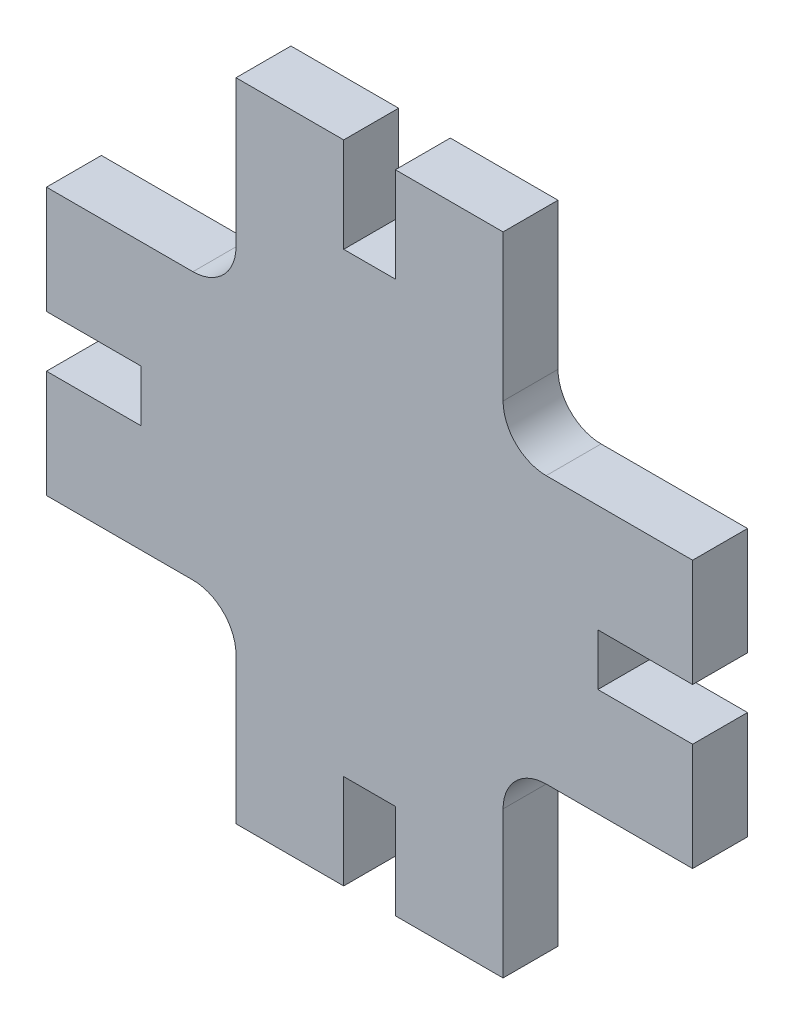
ISO-10303-21;
HEADER;
FILE_DESCRIPTION(('STEP AP214'),'2;1');
FILE_NAME('part.step','',(''),(''),'','','');
FILE_SCHEMA(('AUTOMOTIVE_DESIGN { 1 0 10303 214 1 1 1 1 }'));
ENDSEC;
DATA;
#1=APPLICATION_CONTEXT('core data for automotive mechanical design processes');
#2=APPLICATION_PROTOCOL_DEFINITION('international standard','automotive_design',2000,#1);
#3=PRODUCT_CONTEXT('',#1,'mechanical');
#4=PRODUCT('Part','Part','',(#3));
#5=PRODUCT_RELATED_PRODUCT_CATEGORY('part','',(#4));
#6=PRODUCT_DEFINITION_FORMATION('','',#4);
#7=PRODUCT_DEFINITION_CONTEXT('part definition',#1,'design');
#8=PRODUCT_DEFINITION('design','',#6,#7);
#9=PRODUCT_DEFINITION_SHAPE('','',#8);
#10=(LENGTH_UNIT() NAMED_UNIT(*) SI_UNIT(.MILLI.,.METRE.));
#11=(NAMED_UNIT(*) PLANE_ANGLE_UNIT() SI_UNIT($,.RADIAN.));
#12=(NAMED_UNIT(*) SI_UNIT($,.STERADIAN.) SOLID_ANGLE_UNIT());
#13=UNCERTAINTY_MEASURE_WITH_UNIT(LENGTH_MEASURE(1.E-05),#10,'distance_accuracy_value','');
#14=(GEOMETRIC_REPRESENTATION_CONTEXT(3) GLOBAL_UNCERTAINTY_ASSIGNED_CONTEXT((#13)) GLOBAL_UNIT_ASSIGNED_CONTEXT((#10,
#11,#12)) REPRESENTATION_CONTEXT('',''));
#15=CARTESIAN_POINT('',(0.,0.,0.));
#16=DIRECTION('',(0.,0.,1.));
#17=DIRECTION('',(1.,0.,0.));
#18=AXIS2_PLACEMENT_3D('',#15,#16,#17);
#19=CARTESIAN_POINT('',(0.,0.,5.1));
#20=DIRECTION('',(1.,0.,0.));
#21=DIRECTION('',(0.,1.,0.));
#22=AXIS2_PLACEMENT_3D('',#19,#20,#21);
#23=PLANE('',#22);
#24=DIRECTION('',(0.,-1.,0.));
#25=VECTOR('',#24,1.);
#26=CARTESIAN_POINT('',(0.,0.,0.));
#27=LINE('',#26,#25);
#28=CARTESIAN_POINT('',(0.,13.6,0.));
#29=VERTEX_POINT('',#28);
#30=CARTESIAN_POINT('',(0.,0.,0.));
#31=VERTEX_POINT('',#30);
#32=EDGE_CURVE('E273',#29,#31,#27,.T.);
#33=ORIENTED_EDGE('',*,*,#32,.T.);
#34=DIRECTION('',(0.,0.,-1.));
#35=VECTOR('',#34,1.);
#36=CARTESIAN_POINT('',(0.,0.,5.1));
#37=LINE('',#36,#35);
#38=CARTESIAN_POINT('',(0.,0.,5.1));
#39=VERTEX_POINT('',#38);
#40=EDGE_CURVE('E11',#39,#31,#37,.T.);
#41=ORIENTED_EDGE('',*,*,#40,.F.);
#42=DIRECTION('',(0.,-1.,0.));
#43=VECTOR('',#42,1.);
#44=CARTESIAN_POINT('',(0.,0.,5.1));
#45=LINE('',#44,#43);
#46=CARTESIAN_POINT('',(0.,13.6,5.1));
#47=VERTEX_POINT('',#46);
#48=EDGE_CURVE('E335',#47,#39,#45,.T.);
#49=ORIENTED_EDGE('',*,*,#48,.F.);
#50=DIRECTION('',(0.,0.,-1.));
#51=VECTOR('',#50,1.);
#52=CARTESIAN_POINT('',(0.,13.6,5.1));
#53=LINE('',#52,#51);
#54=EDGE_CURVE('E269',#47,#29,#53,.T.);
#55=ORIENTED_EDGE('',*,*,#54,.T.);
#56=EDGE_LOOP('',(#33,#41,#49,#55));
#57=FACE_BOUND('',#56,.T.);
#58=ADVANCED_FACE('F33',(#57),#23,.F.);
#59=CARTESIAN_POINT('',(0.,0.,5.1));
#60=DIRECTION('',(0.,1.,0.));
#61=DIRECTION('',(-1.,0.,0.));
#62=AXIS2_PLACEMENT_3D('',#59,#60,#61);
#63=PLANE('',#62);
#64=DIRECTION('',(1.,0.,0.));
#65=VECTOR('',#64,1.);
#66=CARTESIAN_POINT('',(0.,0.,0.));
#67=LINE('',#66,#65);
#68=CARTESIAN_POINT('',(10.,0.,0.));
#69=VERTEX_POINT('',#68);
#70=EDGE_CURVE('E276',#31,#69,#67,.T.);
#71=ORIENTED_EDGE('',*,*,#70,.T.);
#72=DIRECTION('',(0.,0.,-1.));
#73=VECTOR('',#72,1.);
#74=CARTESIAN_POINT('',(10.,0.,5.1));
#75=LINE('',#74,#73);
#76=CARTESIAN_POINT('',(10.,0.,5.1));
#77=VERTEX_POINT('',#76);
#78=EDGE_CURVE('E41',#77,#69,#75,.T.);
#79=ORIENTED_EDGE('',*,*,#78,.F.);
#80=DIRECTION('',(1.,0.,0.));
#81=VECTOR('',#80,1.);
#82=CARTESIAN_POINT('',(0.,0.,5.1));
#83=LINE('',#82,#81);
#84=EDGE_CURVE('E164',#39,#77,#83,.T.);
#85=ORIENTED_EDGE('',*,*,#84,.F.);
#86=ORIENTED_EDGE('',*,*,#40,.T.);
#87=EDGE_LOOP('',(#71,#79,#85,#86));
#88=FACE_BOUND('',#87,.T.);
#89=ADVANCED_FACE('F513',(#88),#63,.F.);
#90=CARTESIAN_POINT('',(10.,0.,5.1));
#91=DIRECTION('',(-1.,0.,0.));
#92=DIRECTION('',(0.,-1.,0.));
#93=AXIS2_PLACEMENT_3D('',#90,#91,#92);
#94=PLANE('',#93);
#95=DIRECTION('',(0.,1.,0.));
#96=VECTOR('',#95,1.);
#97=CARTESIAN_POINT('',(10.,0.,0.));
#98=LINE('',#97,#96);
#99=CARTESIAN_POINT('',(10.,8.8,0.));
#100=VERTEX_POINT('',#99);
#101=EDGE_CURVE('E278',#69,#100,#98,.T.);
#102=ORIENTED_EDGE('',*,*,#101,.T.);
#103=DIRECTION('',(0.,0.,-1.));
#104=VECTOR('',#103,1.);
#105=CARTESIAN_POINT('',(10.,8.8,5.1));
#106=LINE('',#105,#104);
#107=CARTESIAN_POINT('',(10.,8.8,5.1));
#108=VERTEX_POINT('',#107);
#109=EDGE_CURVE('E414',#108,#100,#106,.T.);
#110=ORIENTED_EDGE('',*,*,#109,.F.);
#111=DIRECTION('',(0.,1.,0.));
#112=VECTOR('',#111,1.);
#113=CARTESIAN_POINT('',(10.,0.,5.1));
#114=LINE('',#113,#112);
#115=EDGE_CURVE('E422',#77,#108,#114,.T.);
#116=ORIENTED_EDGE('',*,*,#115,.F.);
#117=ORIENTED_EDGE('',*,*,#78,.T.);
#118=EDGE_LOOP('',(#102,#110,#116,#117));
#119=FACE_BOUND('',#118,.T.);
#120=ADVANCED_FACE('F420',(#119),#94,.F.);
#121=CARTESIAN_POINT('',(10.,8.8,5.1));
#122=DIRECTION('',(0.,1.,0.));
#123=DIRECTION('',(0.,0.,1.));
#124=AXIS2_PLACEMENT_3D('',#121,#122,#123);
#125=PLANE('',#124);
#126=DIRECTION('',(1.,0.,0.));
#127=VECTOR('',#126,1.);
#128=CARTESIAN_POINT('',(10.,8.8,0.));
#129=LINE('',#128,#127);
#130=CARTESIAN_POINT('',(14.8,8.8,0.));
#131=VERTEX_POINT('',#130);
#132=EDGE_CURVE('E280',#100,#131,#129,.T.);
#133=ORIENTED_EDGE('',*,*,#132,.T.);
#134=DIRECTION('',(0.,0.,-1.));
#135=VECTOR('',#134,1.);
#136=CARTESIAN_POINT('',(14.8,8.8,5.1));
#137=LINE('',#136,#135);
#138=CARTESIAN_POINT('',(14.8,8.8,5.1));
#139=VERTEX_POINT('',#138);
#140=EDGE_CURVE('E411',#139,#131,#137,.T.);
#141=ORIENTED_EDGE('',*,*,#140,.F.);
#142=DIRECTION('',(1.,0.,0.));
#143=VECTOR('',#142,1.);
#144=CARTESIAN_POINT('',(10.,8.8,5.1));
#145=LINE('',#144,#143);
#146=EDGE_CURVE('E440',#108,#139,#145,.T.);
#147=ORIENTED_EDGE('',*,*,#146,.F.);
#148=ORIENTED_EDGE('',*,*,#109,.T.);
#149=EDGE_LOOP('',(#133,#141,#147,#148));
#150=FACE_BOUND('',#149,.T.);
#151=ADVANCED_FACE('F431',(#150),#125,.F.);
#152=CARTESIAN_POINT('',(14.8,8.8,5.1));
#153=DIRECTION('',(1.,0.,0.));
#154=DIRECTION('',(0.,1.,0.));
#155=AXIS2_PLACEMENT_3D('',#152,#153,#154);
#156=PLANE('',#155);
#157=DIRECTION('',(0.,-1.,0.));
#158=VECTOR('',#157,1.);
#159=CARTESIAN_POINT('',(14.8,8.8,0.));
#160=LINE('',#159,#158);
#161=CARTESIAN_POINT('',(14.8,0.,0.));
#162=VERTEX_POINT('',#161);
#163=EDGE_CURVE('E282',#131,#162,#160,.T.);
#164=ORIENTED_EDGE('',*,*,#163,.T.);
#165=DIRECTION('',(0.,0.,-1.));
#166=VECTOR('',#165,1.);
#167=CARTESIAN_POINT('',(14.8,0.,5.1));
#168=LINE('',#167,#166);
#169=CARTESIAN_POINT('',(14.8,0.,5.1));
#170=VERTEX_POINT('',#169);
#171=EDGE_CURVE('E408',#170,#162,#168,.T.);
#172=ORIENTED_EDGE('',*,*,#171,.F.);
#173=DIRECTION('',(0.,-1.,0.));
#174=VECTOR('',#173,1.);
#175=CARTESIAN_POINT('',(14.8,8.8,5.1));
#176=LINE('',#175,#174);
#177=EDGE_CURVE('E437',#139,#170,#176,.T.);
#178=ORIENTED_EDGE('',*,*,#177,.F.);
#179=ORIENTED_EDGE('',*,*,#140,.T.);
#180=EDGE_LOOP('',(#164,#172,#178,#179));
#181=FACE_BOUND('',#180,.T.);
#182=ADVANCED_FACE('F435',(#181),#156,.F.);
#183=CARTESIAN_POINT('',(14.8,0.,5.1));
#184=DIRECTION('',(0.,1.,0.));
#185=DIRECTION('',(-1.,0.,0.));
#186=AXIS2_PLACEMENT_3D('',#183,#184,#185);
#187=PLANE('',#186);
#188=DIRECTION('',(1.,0.,0.));
#189=VECTOR('',#188,1.);
#190=CARTESIAN_POINT('',(14.8,0.,0.));
#191=LINE('',#190,#189);
#192=CARTESIAN_POINT('',(24.8,0.,0.));
#193=VERTEX_POINT('',#192);
#194=EDGE_CURVE('E284',#162,#193,#191,.T.);
#195=ORIENTED_EDGE('',*,*,#194,.T.);
#196=DIRECTION('',(0.,0.,-1.));
#197=VECTOR('',#196,1.);
#198=CARTESIAN_POINT('',(24.8,0.,5.1));
#199=LINE('',#198,#197);
#200=CARTESIAN_POINT('',(24.8,0.,5.1));
#201=VERTEX_POINT('',#200);
#202=EDGE_CURVE('E405',#201,#193,#199,.T.);
#203=ORIENTED_EDGE('',*,*,#202,.F.);
#204=DIRECTION('',(1.,0.,0.));
#205=VECTOR('',#204,1.);
#206=CARTESIAN_POINT('',(14.8,0.,5.1));
#207=LINE('',#206,#205);
#208=EDGE_CURVE('E439',#170,#201,#207,.T.);
#209=ORIENTED_EDGE('',*,*,#208,.F.);
#210=ORIENTED_EDGE('',*,*,#171,.T.);
#211=EDGE_LOOP('',(#195,#203,#209,#210));
#212=FACE_BOUND('',#211,.T.);
#213=ADVANCED_FACE('F526',(#212),#187,.F.);
#214=CARTESIAN_POINT('',(24.8,0.,5.1));
#215=DIRECTION('',(-1.,0.,0.));
#216=DIRECTION('',(0.,-1.,0.));
#217=AXIS2_PLACEMENT_3D('',#214,#215,#216);
#218=PLANE('',#217);
#219=DIRECTION('',(0.,1.,0.));
#220=VECTOR('',#219,1.);
#221=CARTESIAN_POINT('',(24.8,0.,0.));
#222=LINE('',#221,#220);
#223=CARTESIAN_POINT('',(24.8,13.6,0.));
#224=VERTEX_POINT('',#223);
#225=EDGE_CURVE('E286',#193,#224,#222,.T.);
#226=ORIENTED_EDGE('',*,*,#225,.T.);
#227=DIRECTION('',(0.,0.,-1.));
#228=VECTOR('',#227,1.);
#229=CARTESIAN_POINT('',(24.8,13.6,5.1));
#230=LINE('',#229,#228);
#231=CARTESIAN_POINT('',(24.8,13.6,5.1));
#232=VERTEX_POINT('',#231);
#233=EDGE_CURVE('E402',#232,#224,#230,.T.);
#234=ORIENTED_EDGE('',*,*,#233,.F.);
#235=DIRECTION('',(0.,1.,0.));
#236=VECTOR('',#235,1.);
#237=CARTESIAN_POINT('',(24.8,0.,5.1));
#238=LINE('',#237,#236);
#239=EDGE_CURVE('E442',#201,#232,#238,.T.);
#240=ORIENTED_EDGE('',*,*,#239,.F.);
#241=ORIENTED_EDGE('',*,*,#202,.T.);
#242=EDGE_LOOP('',(#226,#234,#240,#241));
#243=FACE_BOUND('',#242,.T.);
#244=ADVANCED_FACE('F529',(#243),#218,.F.);
#245=CARTESIAN_POINT('',(28.8,13.6,5.1));
#246=DIRECTION('',(0.,0.,-1.));
#247=DIRECTION('',(-1.,0.,0.));
#248=AXIS2_PLACEMENT_3D('',#245,#246,#247);
#249=CYLINDRICAL_SURFACE('',#248,3.99999999999999);
#250=CARTESIAN_POINT('',(28.8,13.6,0.));
#251=DIRECTION('',(0.,0.,-1.));
#252=DIRECTION('',(-1.,0.,0.));
#253=AXIS2_PLACEMENT_3D('',#250,#251,#252);
#254=CIRCLE('',#253,3.99999999999999);
#255=CARTESIAN_POINT('',(28.8,17.6,0.));
#256=VERTEX_POINT('',#255);
#257=EDGE_CURVE('E288',#224,#256,#254,.T.);
#258=ORIENTED_EDGE('',*,*,#257,.T.);
#259=DIRECTION('',(0.,0.,-1.));
#260=VECTOR('',#259,1.);
#261=CARTESIAN_POINT('',(28.8,17.6,5.1));
#262=LINE('',#261,#260);
#263=CARTESIAN_POINT('',(28.8,17.6,5.1));
#264=VERTEX_POINT('',#263);
#265=EDGE_CURVE('E399',#264,#256,#262,.T.);
#266=ORIENTED_EDGE('',*,*,#265,.F.);
#267=CARTESIAN_POINT('',(28.8,13.6,5.1));
#268=DIRECTION('',(0.,0.,-1.));
#269=DIRECTION('',(-1.,0.,0.));
#270=AXIS2_PLACEMENT_3D('',#267,#268,#269);
#271=CIRCLE('',#270,3.99999999999999);
#272=EDGE_CURVE('E448',#232,#264,#271,.T.);
#273=ORIENTED_EDGE('',*,*,#272,.F.);
#274=ORIENTED_EDGE('',*,*,#233,.T.);
#275=EDGE_LOOP('',(#258,#266,#273,#274));
#276=FACE_BOUND('',#275,.T.);
#277=ADVANCED_FACE('F533',(#276),#249,.F.);
#278=CARTESIAN_POINT('',(42.4,17.6,5.1));
#279=DIRECTION('',(0.,1.,0.));
#280=DIRECTION('',(-1.,0.,0.));
#281=AXIS2_PLACEMENT_3D('',#278,#279,#280);
#282=PLANE('',#281);
#283=DIRECTION('',(1.,0.,0.));
#284=VECTOR('',#283,1.);
#285=CARTESIAN_POINT('',(42.4,17.6,0.));
#286=LINE('',#285,#284);
#287=CARTESIAN_POINT('',(42.4,17.6,0.));
#288=VERTEX_POINT('',#287);
#289=EDGE_CURVE('E290',#256,#288,#286,.T.);
#290=ORIENTED_EDGE('',*,*,#289,.T.);
#291=DIRECTION('',(0.,0.,-1.));
#292=VECTOR('',#291,1.);
#293=CARTESIAN_POINT('',(42.4,17.6,5.1));
#294=LINE('',#293,#292);
#295=CARTESIAN_POINT('',(42.4,17.6,5.1));
#296=VERTEX_POINT('',#295);
#297=EDGE_CURVE('E396',#296,#288,#294,.T.);
#298=ORIENTED_EDGE('',*,*,#297,.F.);
#299=DIRECTION('',(1.,0.,0.));
#300=VECTOR('',#299,1.);
#301=CARTESIAN_POINT('',(42.4,17.6,5.1));
#302=LINE('',#301,#300);
#303=EDGE_CURVE('E450',#264,#296,#302,.T.);
#304=ORIENTED_EDGE('',*,*,#303,.F.);
#305=ORIENTED_EDGE('',*,*,#265,.T.);
#306=EDGE_LOOP('',(#290,#298,#304,#305));
#307=FACE_BOUND('',#306,.T.);
#308=ADVANCED_FACE('F537',(#307),#282,.F.);
#309=CARTESIAN_POINT('',(42.4,27.6,5.1));
#310=DIRECTION('',(-1.,0.,0.));
#311=DIRECTION('',(0.,0.,1.));
#312=AXIS2_PLACEMENT_3D('',#309,#310,#311);
#313=PLANE('',#312);
#314=DIRECTION('',(0.,1.,0.));
#315=VECTOR('',#314,1.);
#316=CARTESIAN_POINT('',(42.4,27.6,0.));
#317=LINE('',#316,#315);
#318=CARTESIAN_POINT('',(42.4,27.6,0.));
#319=VERTEX_POINT('',#318);
#320=EDGE_CURVE('E292',#288,#319,#317,.T.);
#321=ORIENTED_EDGE('',*,*,#320,.T.);
#322=DIRECTION('',(0.,0.,-1.));
#323=VECTOR('',#322,1.);
#324=CARTESIAN_POINT('',(42.4,27.6,5.1));
#325=LINE('',#324,#323);
#326=CARTESIAN_POINT('',(42.4,27.6,5.1));
#327=VERTEX_POINT('',#326);
#328=EDGE_CURVE('E393',#327,#319,#325,.T.);
#329=ORIENTED_EDGE('',*,*,#328,.F.);
#330=DIRECTION('',(0.,1.,0.));
#331=VECTOR('',#330,1.);
#332=CARTESIAN_POINT('',(42.4,27.6,5.1));
#333=LINE('',#332,#331);
#334=EDGE_CURVE('E452',#296,#327,#333,.T.);
#335=ORIENTED_EDGE('',*,*,#334,.F.);
#336=ORIENTED_EDGE('',*,*,#297,.T.);
#337=EDGE_LOOP('',(#321,#329,#335,#336));
#338=FACE_BOUND('',#337,.T.);
#339=ADVANCED_FACE('F541',(#338),#313,.F.);
#340=CARTESIAN_POINT('',(33.6,27.6,5.1));
#341=DIRECTION('',(0.,-1.,0.));
#342=DIRECTION('',(0.,0.,-1.));
#343=AXIS2_PLACEMENT_3D('',#340,#341,#342);
#344=PLANE('',#343);
#345=DIRECTION('',(-1.,0.,0.));
#346=VECTOR('',#345,1.);
#347=CARTESIAN_POINT('',(33.6,27.6,0.));
#348=LINE('',#347,#346);
#349=CARTESIAN_POINT('',(33.6,27.6,0.));
#350=VERTEX_POINT('',#349);
#351=EDGE_CURVE('E294',#319,#350,#348,.T.);
#352=ORIENTED_EDGE('',*,*,#351,.T.);
#353=DIRECTION('',(0.,0.,-1.));
#354=VECTOR('',#353,1.);
#355=CARTESIAN_POINT('',(33.6,27.6,5.1));
#356=LINE('',#355,#354);
#357=CARTESIAN_POINT('',(33.6,27.6,5.1));
#358=VERTEX_POINT('',#357);
#359=EDGE_CURVE('E390',#358,#350,#356,.T.);
#360=ORIENTED_EDGE('',*,*,#359,.F.);
#361=DIRECTION('',(-1.,0.,0.));
#362=VECTOR('',#361,1.);
#363=CARTESIAN_POINT('',(33.6,27.6,5.1));
#364=LINE('',#363,#362);
#365=EDGE_CURVE('E454',#327,#358,#364,.T.);
#366=ORIENTED_EDGE('',*,*,#365,.F.);
#367=ORIENTED_EDGE('',*,*,#328,.T.);
#368=EDGE_LOOP('',(#352,#360,#366,#367));
#369=FACE_BOUND('',#368,.T.);
#370=ADVANCED_FACE('F545',(#369),#344,.F.);
#371=CARTESIAN_POINT('',(33.6,32.4,5.1));
#372=DIRECTION('',(-1.,0.,0.));
#373=DIRECTION('',(0.,0.,1.));
#374=AXIS2_PLACEMENT_3D('',#371,#372,#373);
#375=PLANE('',#374);
#376=DIRECTION('',(0.,1.,0.));
#377=VECTOR('',#376,1.);
#378=CARTESIAN_POINT('',(33.6,32.4,0.));
#379=LINE('',#378,#377);
#380=CARTESIAN_POINT('',(33.6,32.4,0.));
#381=VERTEX_POINT('',#380);
#382=EDGE_CURVE('E296',#350,#381,#379,.T.);
#383=ORIENTED_EDGE('',*,*,#382,.T.);
#384=DIRECTION('',(0.,0.,-1.));
#385=VECTOR('',#384,1.);
#386=CARTESIAN_POINT('',(33.6,32.4,5.1));
#387=LINE('',#386,#385);
#388=CARTESIAN_POINT('',(33.6,32.4,5.1));
#389=VERTEX_POINT('',#388);
#390=EDGE_CURVE('E387',#389,#381,#387,.T.);
#391=ORIENTED_EDGE('',*,*,#390,.F.);
#392=DIRECTION('',(0.,1.,0.));
#393=VECTOR('',#392,1.);
#394=CARTESIAN_POINT('',(33.6,32.4,5.1));
#395=LINE('',#394,#393);
#396=EDGE_CURVE('E456',#358,#389,#395,.T.);
#397=ORIENTED_EDGE('',*,*,#396,.F.);
#398=ORIENTED_EDGE('',*,*,#359,.T.);
#399=EDGE_LOOP('',(#383,#391,#397,#398));
#400=FACE_BOUND('',#399,.T.);
#401=ADVANCED_FACE('F549',(#400),#375,.F.);
#402=CARTESIAN_POINT('',(42.4,32.4,5.1));
#403=DIRECTION('',(0.,1.,0.));
#404=DIRECTION('',(0.,0.,1.));
#405=AXIS2_PLACEMENT_3D('',#402,#403,#404);
#406=PLANE('',#405);
#407=DIRECTION('',(1.,0.,0.));
#408=VECTOR('',#407,1.);
#409=CARTESIAN_POINT('',(42.4,32.4,0.));
#410=LINE('',#409,#408);
#411=CARTESIAN_POINT('',(42.4,32.4,0.));
#412=VERTEX_POINT('',#411);
#413=EDGE_CURVE('E298',#381,#412,#410,.T.);
#414=ORIENTED_EDGE('',*,*,#413,.T.);
#415=DIRECTION('',(0.,0.,-1.));
#416=VECTOR('',#415,1.);
#417=CARTESIAN_POINT('',(42.4,32.4,5.1));
#418=LINE('',#417,#416);
#419=CARTESIAN_POINT('',(42.4,32.4,5.1));
#420=VERTEX_POINT('',#419);
#421=EDGE_CURVE('E384',#420,#412,#418,.T.);
#422=ORIENTED_EDGE('',*,*,#421,.F.);
#423=DIRECTION('',(1.,0.,0.));
#424=VECTOR('',#423,1.);
#425=CARTESIAN_POINT('',(42.4,32.4,5.1));
#426=LINE('',#425,#424);
#427=EDGE_CURVE('E458',#389,#420,#426,.T.);
#428=ORIENTED_EDGE('',*,*,#427,.F.);
#429=ORIENTED_EDGE('',*,*,#390,.T.);
#430=EDGE_LOOP('',(#414,#422,#428,#429));
#431=FACE_BOUND('',#430,.T.);
#432=ADVANCED_FACE('F553',(#431),#406,.F.);
#433=CARTESIAN_POINT('',(42.4,42.4,5.1));
#434=DIRECTION('',(-1.,0.,0.));
#435=DIRECTION('',(0.,0.,1.));
#436=AXIS2_PLACEMENT_3D('',#433,#434,#435);
#437=PLANE('',#436);
#438=DIRECTION('',(0.,1.,0.));
#439=VECTOR('',#438,1.);
#440=CARTESIAN_POINT('',(42.4,42.4,0.));
#441=LINE('',#440,#439);
#442=CARTESIAN_POINT('',(42.4,42.4,0.));
#443=VERTEX_POINT('',#442);
#444=EDGE_CURVE('E300',#412,#443,#441,.T.);
#445=ORIENTED_EDGE('',*,*,#444,.T.);
#446=DIRECTION('',(0.,0.,-1.));
#447=VECTOR('',#446,1.);
#448=CARTESIAN_POINT('',(42.4,42.4,5.1));
#449=LINE('',#448,#447);
#450=CARTESIAN_POINT('',(42.4,42.4,5.1));
#451=VERTEX_POINT('',#450);
#452=EDGE_CURVE('E381',#451,#443,#449,.T.);
#453=ORIENTED_EDGE('',*,*,#452,.F.);
#454=DIRECTION('',(0.,1.,0.));
#455=VECTOR('',#454,1.);
#456=CARTESIAN_POINT('',(42.4,42.4,5.1));
#457=LINE('',#456,#455);
#458=EDGE_CURVE('E460',#420,#451,#457,.T.);
#459=ORIENTED_EDGE('',*,*,#458,.F.);
#460=ORIENTED_EDGE('',*,*,#421,.T.);
#461=EDGE_LOOP('',(#445,#453,#459,#460));
#462=FACE_BOUND('',#461,.T.);
#463=ADVANCED_FACE('F557',(#462),#437,.F.);
#464=CARTESIAN_POINT('',(28.8,42.4,5.1));
#465=DIRECTION('',(0.,-1.,0.));
#466=DIRECTION('',(0.,0.,-1.));
#467=AXIS2_PLACEMENT_3D('',#464,#465,#466);
#468=PLANE('',#467);
#469=DIRECTION('',(-1.,0.,0.));
#470=VECTOR('',#469,1.);
#471=CARTESIAN_POINT('',(28.8,42.4,0.));
#472=LINE('',#471,#470);
#473=CARTESIAN_POINT('',(28.8,42.4,0.));
#474=VERTEX_POINT('',#473);
#475=EDGE_CURVE('E302',#443,#474,#472,.T.);
#476=ORIENTED_EDGE('',*,*,#475,.T.);
#477=DIRECTION('',(0.,0.,-1.));
#478=VECTOR('',#477,1.);
#479=CARTESIAN_POINT('',(28.8,42.4,5.1));
#480=LINE('',#479,#478);
#481=CARTESIAN_POINT('',(28.8,42.4,5.1));
#482=VERTEX_POINT('',#481);
#483=EDGE_CURVE('E378',#482,#474,#480,.T.);
#484=ORIENTED_EDGE('',*,*,#483,.F.);
#485=DIRECTION('',(-1.,0.,0.));
#486=VECTOR('',#485,1.);
#487=CARTESIAN_POINT('',(28.8,42.4,5.1));
#488=LINE('',#487,#486);
#489=EDGE_CURVE('E462',#451,#482,#488,.T.);
#490=ORIENTED_EDGE('',*,*,#489,.F.);
#491=ORIENTED_EDGE('',*,*,#452,.T.);
#492=EDGE_LOOP('',(#476,#484,#490,#491));
#493=FACE_BOUND('',#492,.T.);
#494=ADVANCED_FACE('F561',(#493),#468,.F.);
#495=CARTESIAN_POINT('',(28.8,46.4,5.1));
#496=DIRECTION('',(0.,0.,-1.));
#497=DIRECTION('',(-1.,0.,0.));
#498=AXIS2_PLACEMENT_3D('',#495,#496,#497);
#499=CYLINDRICAL_SURFACE('',#498,3.99999999999999);
#500=CARTESIAN_POINT('',(28.8,46.4,0.));
#501=DIRECTION('',(0.,0.,-1.));
#502=DIRECTION('',(1.,0.,0.));
#503=AXIS2_PLACEMENT_3D('',#500,#501,#502);
#504=CIRCLE('',#503,3.99999999999999);
#505=CARTESIAN_POINT('',(24.8,46.4,0.));
#506=VERTEX_POINT('',#505);
#507=EDGE_CURVE('E304',#474,#506,#504,.T.);
#508=ORIENTED_EDGE('',*,*,#507,.T.);
#509=DIRECTION('',(0.,0.,-1.));
#510=VECTOR('',#509,1.);
#511=CARTESIAN_POINT('',(24.8,46.4,5.1));
#512=LINE('',#511,#510);
#513=CARTESIAN_POINT('',(24.8,46.4,5.1));
#514=VERTEX_POINT('',#513);
#515=EDGE_CURVE('E375',#514,#506,#512,.T.);
#516=ORIENTED_EDGE('',*,*,#515,.F.);
#517=CARTESIAN_POINT('',(28.8,46.4,5.1));
#518=DIRECTION('',(0.,0.,-1.));
#519=DIRECTION('',(1.,0.,0.));
#520=AXIS2_PLACEMENT_3D('',#517,#518,#519);
#521=CIRCLE('',#520,3.99999999999999);
#522=EDGE_CURVE('E464',#482,#514,#521,.T.);
#523=ORIENTED_EDGE('',*,*,#522,.F.);
#524=ORIENTED_EDGE('',*,*,#483,.T.);
#525=EDGE_LOOP('',(#508,#516,#523,#524));
#526=FACE_BOUND('',#525,.T.);
#527=ADVANCED_FACE('F565',(#526),#499,.F.);
#528=CARTESIAN_POINT('',(24.8,60.,5.1));
#529=DIRECTION('',(-1.,0.,0.));
#530=DIRECTION('',(0.,-1.,0.));
#531=AXIS2_PLACEMENT_3D('',#528,#529,#530);
#532=PLANE('',#531);
#533=DIRECTION('',(0.,1.,0.));
#534=VECTOR('',#533,1.);
#535=CARTESIAN_POINT('',(24.8,60.,0.));
#536=LINE('',#535,#534);
#537=CARTESIAN_POINT('',(24.8,60.,0.));
#538=VERTEX_POINT('',#537);
#539=EDGE_CURVE('E306',#506,#538,#536,.T.);
#540=ORIENTED_EDGE('',*,*,#539,.T.);
#541=DIRECTION('',(0.,0.,-1.));
#542=VECTOR('',#541,1.);
#543=CARTESIAN_POINT('',(24.8,60.,5.1));
#544=LINE('',#543,#542);
#545=CARTESIAN_POINT('',(24.8,60.,5.1));
#546=VERTEX_POINT('',#545);
#547=EDGE_CURVE('E372',#546,#538,#544,.T.);
#548=ORIENTED_EDGE('',*,*,#547,.F.);
#549=DIRECTION('',(0.,1.,0.));
#550=VECTOR('',#549,1.);
#551=CARTESIAN_POINT('',(24.8,60.,5.1));
#552=LINE('',#551,#550);
#553=EDGE_CURVE('E466',#514,#546,#552,.T.);
#554=ORIENTED_EDGE('',*,*,#553,.F.);
#555=ORIENTED_EDGE('',*,*,#515,.T.);
#556=EDGE_LOOP('',(#540,#548,#554,#555));
#557=FACE_BOUND('',#556,.T.);
#558=ADVANCED_FACE('F569',(#557),#532,.F.);
#559=CARTESIAN_POINT('',(14.8,60.,5.1));
#560=DIRECTION('',(0.,-1.,0.));
#561=DIRECTION('',(1.,0.,0.));
#562=AXIS2_PLACEMENT_3D('',#559,#560,#561);
#563=PLANE('',#562);
#564=DIRECTION('',(-1.,0.,0.));
#565=VECTOR('',#564,1.);
#566=CARTESIAN_POINT('',(14.8,60.,0.));
#567=LINE('',#566,#565);
#568=CARTESIAN_POINT('',(14.8,60.,0.));
#569=VERTEX_POINT('',#568);
#570=EDGE_CURVE('E308',#538,#569,#567,.T.);
#571=ORIENTED_EDGE('',*,*,#570,.T.);
#572=DIRECTION('',(0.,0.,-1.));
#573=VECTOR('',#572,1.);
#574=CARTESIAN_POINT('',(14.8,60.,5.1));
#575=LINE('',#574,#573);
#576=CARTESIAN_POINT('',(14.8,60.,5.1));
#577=VERTEX_POINT('',#576);
#578=EDGE_CURVE('E369',#577,#569,#575,.T.);
#579=ORIENTED_EDGE('',*,*,#578,.F.);
#580=DIRECTION('',(-1.,0.,0.));
#581=VECTOR('',#580,1.);
#582=CARTESIAN_POINT('',(14.8,60.,5.1));
#583=LINE('',#582,#581);
#584=EDGE_CURVE('E468',#546,#577,#583,.T.);
#585=ORIENTED_EDGE('',*,*,#584,.F.);
#586=ORIENTED_EDGE('',*,*,#547,.T.);
#587=EDGE_LOOP('',(#571,#579,#585,#586));
#588=FACE_BOUND('',#587,.T.);
#589=ADVANCED_FACE('F573',(#588),#563,.F.);
#590=CARTESIAN_POINT('',(14.8,51.2,5.1));
#591=DIRECTION('',(1.,0.,0.));
#592=DIRECTION('',(0.,1.,0.));
#593=AXIS2_PLACEMENT_3D('',#590,#591,#592);
#594=PLANE('',#593);
#595=DIRECTION('',(0.,-1.,0.));
#596=VECTOR('',#595,1.);
#597=CARTESIAN_POINT('',(14.8,51.2,0.));
#598=LINE('',#597,#596);
#599=CARTESIAN_POINT('',(14.8,51.2,0.));
#600=VERTEX_POINT('',#599);
#601=EDGE_CURVE('E310',#569,#600,#598,.T.);
#602=ORIENTED_EDGE('',*,*,#601,.T.);
#603=DIRECTION('',(0.,0.,-1.));
#604=VECTOR('',#603,1.);
#605=CARTESIAN_POINT('',(14.8,51.2,5.1));
#606=LINE('',#605,#604);
#607=CARTESIAN_POINT('',(14.8,51.2,5.1));
#608=VERTEX_POINT('',#607);
#609=EDGE_CURVE('E366',#608,#600,#606,.T.);
#610=ORIENTED_EDGE('',*,*,#609,.F.);
#611=DIRECTION('',(0.,-1.,0.));
#612=VECTOR('',#611,1.);
#613=CARTESIAN_POINT('',(14.8,51.2,5.1));
#614=LINE('',#613,#612);
#615=EDGE_CURVE('E470',#577,#608,#614,.T.);
#616=ORIENTED_EDGE('',*,*,#615,.F.);
#617=ORIENTED_EDGE('',*,*,#578,.T.);
#618=EDGE_LOOP('',(#602,#610,#616,#617));
#619=FACE_BOUND('',#618,.T.);
#620=ADVANCED_FACE('F577',(#619),#594,.F.);
#621=CARTESIAN_POINT('',(10.,51.2,5.1));
#622=DIRECTION('',(0.,-1.,0.));
#623=DIRECTION('',(0.,0.,-1.));
#624=AXIS2_PLACEMENT_3D('',#621,#622,#623);
#625=PLANE('',#624);
#626=DIRECTION('',(-1.,0.,0.));
#627=VECTOR('',#626,1.);
#628=CARTESIAN_POINT('',(10.,51.2,0.));
#629=LINE('',#628,#627);
#630=CARTESIAN_POINT('',(10.,51.2,0.));
#631=VERTEX_POINT('',#630);
#632=EDGE_CURVE('E312',#600,#631,#629,.T.);
#633=ORIENTED_EDGE('',*,*,#632,.T.);
#634=DIRECTION('',(0.,0.,-1.));
#635=VECTOR('',#634,1.);
#636=CARTESIAN_POINT('',(10.,51.2,5.1));
#637=LINE('',#636,#635);
#638=CARTESIAN_POINT('',(10.,51.2,5.1));
#639=VERTEX_POINT('',#638);
#640=EDGE_CURVE('E363',#639,#631,#637,.T.);
#641=ORIENTED_EDGE('',*,*,#640,.F.);
#642=DIRECTION('',(-1.,0.,0.));
#643=VECTOR('',#642,1.);
#644=CARTESIAN_POINT('',(10.,51.2,5.1));
#645=LINE('',#644,#643);
#646=EDGE_CURVE('E472',#608,#639,#645,.T.);
#647=ORIENTED_EDGE('',*,*,#646,.F.);
#648=ORIENTED_EDGE('',*,*,#609,.T.);
#649=EDGE_LOOP('',(#633,#641,#647,#648));
#650=FACE_BOUND('',#649,.T.);
#651=ADVANCED_FACE('F581',(#650),#625,.F.);
#652=CARTESIAN_POINT('',(10.,60.,5.1));
#653=DIRECTION('',(-1.,0.,0.));
#654=DIRECTION('',(0.,-1.,0.));
#655=AXIS2_PLACEMENT_3D('',#652,#653,#654);
#656=PLANE('',#655);
#657=DIRECTION('',(0.,1.,0.));
#658=VECTOR('',#657,1.);
#659=CARTESIAN_POINT('',(10.,60.,0.));
#660=LINE('',#659,#658);
#661=CARTESIAN_POINT('',(10.,60.,0.));
#662=VERTEX_POINT('',#661);
#663=EDGE_CURVE('E314',#631,#662,#660,.T.);
#664=ORIENTED_EDGE('',*,*,#663,.T.);
#665=DIRECTION('',(0.,0.,-1.));
#666=VECTOR('',#665,1.);
#667=CARTESIAN_POINT('',(10.,60.,5.1));
#668=LINE('',#667,#666);
#669=CARTESIAN_POINT('',(10.,60.,5.1));
#670=VERTEX_POINT('',#669);
#671=EDGE_CURVE('E360',#670,#662,#668,.T.);
#672=ORIENTED_EDGE('',*,*,#671,.F.);
#673=DIRECTION('',(0.,1.,0.));
#674=VECTOR('',#673,1.);
#675=CARTESIAN_POINT('',(10.,60.,5.1));
#676=LINE('',#675,#674);
#677=EDGE_CURVE('E474',#639,#670,#676,.T.);
#678=ORIENTED_EDGE('',*,*,#677,.F.);
#679=ORIENTED_EDGE('',*,*,#640,.T.);
#680=EDGE_LOOP('',(#664,#672,#678,#679));
#681=FACE_BOUND('',#680,.T.);
#682=ADVANCED_FACE('F585',(#681),#656,.F.);
#683=CARTESIAN_POINT('',(0.,60.,5.1));
#684=DIRECTION('',(0.,-1.,0.));
#685=DIRECTION('',(0.,0.,-1.));
#686=AXIS2_PLACEMENT_3D('',#683,#684,#685);
#687=PLANE('',#686);
#688=DIRECTION('',(-1.,0.,0.));
#689=VECTOR('',#688,1.);
#690=CARTESIAN_POINT('',(0.,60.,0.));
#691=LINE('',#690,#689);
#692=CARTESIAN_POINT('',(0.,60.,0.));
#693=VERTEX_POINT('',#692);
#694=EDGE_CURVE('E316',#662,#693,#691,.T.);
#695=ORIENTED_EDGE('',*,*,#694,.T.);
#696=DIRECTION('',(0.,0.,-1.));
#697=VECTOR('',#696,1.);
#698=CARTESIAN_POINT('',(0.,60.,5.1));
#699=LINE('',#698,#697);
#700=CARTESIAN_POINT('',(0.,60.,5.1));
#701=VERTEX_POINT('',#700);
#702=EDGE_CURVE('E357',#701,#693,#699,.T.);
#703=ORIENTED_EDGE('',*,*,#702,.F.);
#704=DIRECTION('',(-1.,0.,0.));
#705=VECTOR('',#704,1.);
#706=CARTESIAN_POINT('',(0.,60.,5.1));
#707=LINE('',#706,#705);
#708=EDGE_CURVE('E476',#670,#701,#707,.T.);
#709=ORIENTED_EDGE('',*,*,#708,.F.);
#710=ORIENTED_EDGE('',*,*,#671,.T.);
#711=EDGE_LOOP('',(#695,#703,#709,#710));
#712=FACE_BOUND('',#711,.T.);
#713=ADVANCED_FACE('F589',(#712),#687,.F.);
#714=CARTESIAN_POINT('',(0.,46.4,5.1));
#715=DIRECTION('',(1.,0.,0.));
#716=DIRECTION('',(0.,1.,0.));
#717=AXIS2_PLACEMENT_3D('',#714,#715,#716);
#718=PLANE('',#717);
#719=DIRECTION('',(0.,-1.,0.));
#720=VECTOR('',#719,1.);
#721=CARTESIAN_POINT('',(0.,46.4,0.));
#722=LINE('',#721,#720);
#723=CARTESIAN_POINT('',(0.,46.4,0.));
#724=VERTEX_POINT('',#723);
#725=EDGE_CURVE('E318',#693,#724,#722,.T.);
#726=ORIENTED_EDGE('',*,*,#725,.T.);
#727=DIRECTION('',(0.,0.,-1.));
#728=VECTOR('',#727,1.);
#729=CARTESIAN_POINT('',(0.,46.4,5.1));
#730=LINE('',#729,#728);
#731=CARTESIAN_POINT('',(0.,46.4,5.1));
#732=VERTEX_POINT('',#731);
#733=EDGE_CURVE('E354',#732,#724,#730,.T.);
#734=ORIENTED_EDGE('',*,*,#733,.F.);
#735=DIRECTION('',(0.,-1.,0.));
#736=VECTOR('',#735,1.);
#737=CARTESIAN_POINT('',(0.,46.4,5.1));
#738=LINE('',#737,#736);
#739=EDGE_CURVE('E478',#701,#732,#738,.T.);
#740=ORIENTED_EDGE('',*,*,#739,.F.);
#741=ORIENTED_EDGE('',*,*,#702,.T.);
#742=EDGE_LOOP('',(#726,#734,#740,#741));
#743=FACE_BOUND('',#742,.T.);
#744=ADVANCED_FACE('F593',(#743),#718,.F.);
#745=CARTESIAN_POINT('',(-4.,46.4,5.1));
#746=DIRECTION('',(0.,0.,-1.));
#747=DIRECTION('',(-1.,0.,0.));
#748=AXIS2_PLACEMENT_3D('',#745,#746,#747);
#749=CYLINDRICAL_SURFACE('',#748,3.99999999999999);
#750=CARTESIAN_POINT('',(-4.,46.4,0.));
#751=DIRECTION('',(0.,0.,-1.));
#752=DIRECTION('',(1.,0.,0.));
#753=AXIS2_PLACEMENT_3D('',#750,#751,#752);
#754=CIRCLE('',#753,3.99999999999999);
#755=CARTESIAN_POINT('',(-4.,42.4,0.));
#756=VERTEX_POINT('',#755);
#757=EDGE_CURVE('E320',#724,#756,#754,.T.);
#758=ORIENTED_EDGE('',*,*,#757,.T.);
#759=DIRECTION('',(0.,0.,-1.));
#760=VECTOR('',#759,1.);
#761=CARTESIAN_POINT('',(-4.,42.4,5.1));
#762=LINE('',#761,#760);
#763=CARTESIAN_POINT('',(-4.,42.4,5.1));
#764=VERTEX_POINT('',#763);
#765=EDGE_CURVE('E351',#764,#756,#762,.T.);
#766=ORIENTED_EDGE('',*,*,#765,.F.);
#767=CARTESIAN_POINT('',(-4.,46.4,5.1));
#768=DIRECTION('',(0.,0.,-1.));
#769=DIRECTION('',(1.,0.,0.));
#770=AXIS2_PLACEMENT_3D('',#767,#768,#769);
#771=CIRCLE('',#770,3.99999999999999);
#772=EDGE_CURVE('E480',#732,#764,#771,.T.);
#773=ORIENTED_EDGE('',*,*,#772,.F.);
#774=ORIENTED_EDGE('',*,*,#733,.T.);
#775=EDGE_LOOP('',(#758,#766,#773,#774));
#776=FACE_BOUND('',#775,.T.);
#777=ADVANCED_FACE('F597',(#776),#749,.F.);
#778=CARTESIAN_POINT('',(-17.6,42.4,5.1));
#779=DIRECTION('',(0.,-1.,0.));
#780=DIRECTION('',(1.,0.,0.));
#781=AXIS2_PLACEMENT_3D('',#778,#779,#780);
#782=PLANE('',#781);
#783=DIRECTION('',(-1.,0.,0.));
#784=VECTOR('',#783,1.);
#785=CARTESIAN_POINT('',(-17.6,42.4,0.));
#786=LINE('',#785,#784);
#787=CARTESIAN_POINT('',(-17.6,42.4,0.));
#788=VERTEX_POINT('',#787);
#789=EDGE_CURVE('E322',#756,#788,#786,.T.);
#790=ORIENTED_EDGE('',*,*,#789,.T.);
#791=DIRECTION('',(0.,0.,-1.));
#792=VECTOR('',#791,1.);
#793=CARTESIAN_POINT('',(-17.6,42.4,5.1));
#794=LINE('',#793,#792);
#795=CARTESIAN_POINT('',(-17.6,42.4,5.1));
#796=VERTEX_POINT('',#795);
#797=EDGE_CURVE('E348',#796,#788,#794,.T.);
#798=ORIENTED_EDGE('',*,*,#797,.F.);
#799=DIRECTION('',(-1.,0.,0.));
#800=VECTOR('',#799,1.);
#801=CARTESIAN_POINT('',(-17.6,42.4,5.1));
#802=LINE('',#801,#800);
#803=EDGE_CURVE('E482',#764,#796,#802,.T.);
#804=ORIENTED_EDGE('',*,*,#803,.F.);
#805=ORIENTED_EDGE('',*,*,#765,.T.);
#806=EDGE_LOOP('',(#790,#798,#804,#805));
#807=FACE_BOUND('',#806,.T.);
#808=ADVANCED_FACE('F601',(#807),#782,.F.);
#809=CARTESIAN_POINT('',(-17.6,32.4,5.1));
#810=DIRECTION('',(1.,0.,0.));
#811=DIRECTION('',(0.,1.,0.));
#812=AXIS2_PLACEMENT_3D('',#809,#810,#811);
#813=PLANE('',#812);
#814=DIRECTION('',(0.,-1.,0.));
#815=VECTOR('',#814,1.);
#816=CARTESIAN_POINT('',(-17.6,32.4,0.));
#817=LINE('',#816,#815);
#818=CARTESIAN_POINT('',(-17.6,32.4,0.));
#819=VERTEX_POINT('',#818);
#820=EDGE_CURVE('E324',#788,#819,#817,.T.);
#821=ORIENTED_EDGE('',*,*,#820,.T.);
#822=DIRECTION('',(0.,0.,-1.));
#823=VECTOR('',#822,1.);
#824=CARTESIAN_POINT('',(-17.6,32.4,5.1));
#825=LINE('',#824,#823);
#826=CARTESIAN_POINT('',(-17.6,32.4,5.1));
#827=VERTEX_POINT('',#826);
#828=EDGE_CURVE('E345',#827,#819,#825,.T.);
#829=ORIENTED_EDGE('',*,*,#828,.F.);
#830=DIRECTION('',(0.,-1.,0.));
#831=VECTOR('',#830,1.);
#832=CARTESIAN_POINT('',(-17.6,32.4,5.1));
#833=LINE('',#832,#831);
#834=EDGE_CURVE('E484',#796,#827,#833,.T.);
#835=ORIENTED_EDGE('',*,*,#834,.F.);
#836=ORIENTED_EDGE('',*,*,#797,.T.);
#837=EDGE_LOOP('',(#821,#829,#835,#836));
#838=FACE_BOUND('',#837,.T.);
#839=ADVANCED_FACE('F605',(#838),#813,.F.);
#840=CARTESIAN_POINT('',(-8.8,32.4,5.1));
#841=DIRECTION('',(0.,1.,0.));
#842=DIRECTION('',(0.,0.,1.));
#843=AXIS2_PLACEMENT_3D('',#840,#841,#842);
#844=PLANE('',#843);
#845=DIRECTION('',(1.,0.,0.));
#846=VECTOR('',#845,1.);
#847=CARTESIAN_POINT('',(-8.8,32.4,0.));
#848=LINE('',#847,#846);
#849=CARTESIAN_POINT('',(-8.8,32.4,0.));
#850=VERTEX_POINT('',#849);
#851=EDGE_CURVE('E326',#819,#850,#848,.T.);
#852=ORIENTED_EDGE('',*,*,#851,.T.);
#853=DIRECTION('',(0.,0.,-1.));
#854=VECTOR('',#853,1.);
#855=CARTESIAN_POINT('',(-8.8,32.4,5.1));
#856=LINE('',#855,#854);
#857=CARTESIAN_POINT('',(-8.8,32.4,5.1));
#858=VERTEX_POINT('',#857);
#859=EDGE_CURVE('E342',#858,#850,#856,.T.);
#860=ORIENTED_EDGE('',*,*,#859,.F.);
#861=DIRECTION('',(1.,0.,0.));
#862=VECTOR('',#861,1.);
#863=CARTESIAN_POINT('',(-8.8,32.4,5.1));
#864=LINE('',#863,#862);
#865=EDGE_CURVE('E486',#827,#858,#864,.T.);
#866=ORIENTED_EDGE('',*,*,#865,.F.);
#867=ORIENTED_EDGE('',*,*,#828,.T.);
#868=EDGE_LOOP('',(#852,#860,#866,#867));
#869=FACE_BOUND('',#868,.T.);
#870=ADVANCED_FACE('F609',(#869),#844,.F.);
#871=CARTESIAN_POINT('',(-8.8,27.6,5.1));
#872=DIRECTION('',(1.,0.,0.));
#873=DIRECTION('',(0.,1.,0.));
#874=AXIS2_PLACEMENT_3D('',#871,#872,#873);
#875=PLANE('',#874);
#876=DIRECTION('',(0.,-1.,0.));
#877=VECTOR('',#876,1.);
#878=CARTESIAN_POINT('',(-8.8,27.6,0.));
#879=LINE('',#878,#877);
#880=CARTESIAN_POINT('',(-8.8,27.6,0.));
#881=VERTEX_POINT('',#880);
#882=EDGE_CURVE('E328',#850,#881,#879,.T.);
#883=ORIENTED_EDGE('',*,*,#882,.T.);
#884=DIRECTION('',(0.,0.,-1.));
#885=VECTOR('',#884,1.);
#886=CARTESIAN_POINT('',(-8.8,27.6,5.1));
#887=LINE('',#886,#885);
#888=CARTESIAN_POINT('',(-8.8,27.6,5.1));
#889=VERTEX_POINT('',#888);
#890=EDGE_CURVE('E339',#889,#881,#887,.T.);
#891=ORIENTED_EDGE('',*,*,#890,.F.);
#892=DIRECTION('',(0.,-1.,0.));
#893=VECTOR('',#892,1.);
#894=CARTESIAN_POINT('',(-8.8,27.6,5.1));
#895=LINE('',#894,#893);
#896=EDGE_CURVE('E488',#858,#889,#895,.T.);
#897=ORIENTED_EDGE('',*,*,#896,.F.);
#898=ORIENTED_EDGE('',*,*,#859,.T.);
#899=EDGE_LOOP('',(#883,#891,#897,#898));
#900=FACE_BOUND('',#899,.T.);
#901=ADVANCED_FACE('F494',(#900),#875,.F.);
#902=CARTESIAN_POINT('',(-17.6,27.6,5.1));
#903=DIRECTION('',(0.,-1.,0.));
#904=DIRECTION('',(0.,0.,-1.));
#905=AXIS2_PLACEMENT_3D('',#902,#903,#904);
#906=PLANE('',#905);
#907=DIRECTION('',(-1.,0.,0.));
#908=VECTOR('',#907,1.);
#909=CARTESIAN_POINT('',(-17.6,27.6,0.));
#910=LINE('',#909,#908);
#911=CARTESIAN_POINT('',(-17.6,27.6,0.));
#912=VERTEX_POINT('',#911);
#913=EDGE_CURVE('E330',#881,#912,#910,.T.);
#914=ORIENTED_EDGE('',*,*,#913,.T.);
#915=DIRECTION('',(0.,0.,-1.));
#916=VECTOR('',#915,1.);
#917=CARTESIAN_POINT('',(-17.6,27.6,5.1));
#918=LINE('',#917,#916);
#919=CARTESIAN_POINT('',(-17.6,27.6,5.1));
#920=VERTEX_POINT('',#919);
#921=EDGE_CURVE('E264',#920,#912,#918,.T.);
#922=ORIENTED_EDGE('',*,*,#921,.F.);
#923=DIRECTION('',(-1.,0.,0.));
#924=VECTOR('',#923,1.);
#925=CARTESIAN_POINT('',(-17.6,27.6,5.1));
#926=LINE('',#925,#924);
#927=EDGE_CURVE('E255',#889,#920,#926,.T.);
#928=ORIENTED_EDGE('',*,*,#927,.F.);
#929=ORIENTED_EDGE('',*,*,#890,.T.);
#930=EDGE_LOOP('',(#914,#922,#928,#929));
#931=FACE_BOUND('',#930,.T.);
#932=ADVANCED_FACE('F498',(#931),#906,.F.);
#933=CARTESIAN_POINT('',(-17.6,17.6,5.1));
#934=DIRECTION('',(1.,0.,0.));
#935=DIRECTION('',(0.,1.,0.));
#936=AXIS2_PLACEMENT_3D('',#933,#934,#935);
#937=PLANE('',#936);
#938=DIRECTION('',(0.,-1.,0.));
#939=VECTOR('',#938,1.);
#940=CARTESIAN_POINT('',(-17.6,17.6,0.));
#941=LINE('',#940,#939);
#942=CARTESIAN_POINT('',(-17.6,17.6,0.));
#943=VERTEX_POINT('',#942);
#944=EDGE_CURVE('E263',#912,#943,#941,.T.);
#945=ORIENTED_EDGE('',*,*,#944,.T.);
#946=DIRECTION('',(0.,0.,-1.));
#947=VECTOR('',#946,1.);
#948=CARTESIAN_POINT('',(-17.6,17.6,5.1));
#949=LINE('',#948,#947);
#950=CARTESIAN_POINT('',(-17.6,17.6,5.1));
#951=VERTEX_POINT('',#950);
#952=EDGE_CURVE('E260',#951,#943,#949,.T.);
#953=ORIENTED_EDGE('',*,*,#952,.F.);
#954=DIRECTION('',(0.,-1.,0.));
#955=VECTOR('',#954,1.);
#956=CARTESIAN_POINT('',(-17.6,17.6,5.1));
#957=LINE('',#956,#955);
#958=EDGE_CURVE('E249',#920,#951,#957,.T.);
#959=ORIENTED_EDGE('',*,*,#958,.F.);
#960=ORIENTED_EDGE('',*,*,#921,.T.);
#961=EDGE_LOOP('',(#945,#953,#959,#960));
#962=FACE_BOUND('',#961,.T.);
#963=ADVANCED_FACE('F261',(#962),#937,.F.);
#964=CARTESIAN_POINT('',(-4.,17.6,5.1));
#965=DIRECTION('',(0.,1.,0.));
#966=DIRECTION('',(-1.,0.,0.));
#967=AXIS2_PLACEMENT_3D('',#964,#965,#966);
#968=PLANE('',#967);
#969=DIRECTION('',(1.,0.,0.));
#970=VECTOR('',#969,1.);
#971=CARTESIAN_POINT('',(-4.,17.6,0.));
#972=LINE('',#971,#970);
#973=CARTESIAN_POINT('',(-4.,17.6,0.));
#974=VERTEX_POINT('',#973);
#975=EDGE_CURVE('E150',#943,#974,#972,.T.);
#976=ORIENTED_EDGE('',*,*,#975,.T.);
#977=DIRECTION('',(0.,0.,-1.));
#978=VECTOR('',#977,1.);
#979=CARTESIAN_POINT('',(-4.,17.6,5.1));
#980=LINE('',#979,#978);
#981=CARTESIAN_POINT('',(-4.,17.6,5.1));
#982=VERTEX_POINT('',#981);
#983=EDGE_CURVE('E265',#982,#974,#980,.T.);
#984=ORIENTED_EDGE('',*,*,#983,.F.);
#985=DIRECTION('',(1.,0.,0.));
#986=VECTOR('',#985,1.);
#987=CARTESIAN_POINT('',(-4.,17.6,5.1));
#988=LINE('',#987,#986);
#989=EDGE_CURVE('E253',#951,#982,#988,.T.);
#990=ORIENTED_EDGE('',*,*,#989,.F.);
#991=ORIENTED_EDGE('',*,*,#952,.T.);
#992=EDGE_LOOP('',(#976,#984,#990,#991));
#993=FACE_BOUND('',#992,.T.);
#994=ADVANCED_FACE('F267',(#993),#968,.F.);
#995=CARTESIAN_POINT('',(-4.,13.6,5.1));
#996=DIRECTION('',(0.,0.,-1.));
#997=DIRECTION('',(-1.,0.,0.));
#998=AXIS2_PLACEMENT_3D('',#995,#996,#997);
#999=CYLINDRICAL_SURFACE('',#998,3.99999999999999);
#1000=CARTESIAN_POINT('',(-4.,13.6,0.));
#1001=DIRECTION('',(0.,0.,-1.));
#1002=DIRECTION('',(-1.,0.,0.));
#1003=AXIS2_PLACEMENT_3D('',#1000,#1001,#1002);
#1004=CIRCLE('',#1003,3.99999999999999);
#1005=EDGE_CURVE('E156',#974,#29,#1004,.T.);
#1006=ORIENTED_EDGE('',*,*,#1005,.T.);
#1007=ORIENTED_EDGE('',*,*,#54,.F.);
#1008=CARTESIAN_POINT('',(-4.,13.6,5.1));
#1009=DIRECTION('',(0.,0.,-1.));
#1010=DIRECTION('',(-1.,0.,0.));
#1011=AXIS2_PLACEMENT_3D('',#1008,#1009,#1010);
#1012=CIRCLE('',#1011,3.99999999999999);
#1013=EDGE_CURVE('E49',#982,#47,#1012,.T.);
#1014=ORIENTED_EDGE('',*,*,#1013,.F.);
#1015=ORIENTED_EDGE('',*,*,#983,.T.);
#1016=EDGE_LOOP('',(#1006,#1007,#1014,#1015));
#1017=FACE_BOUND('',#1016,.T.);
#1018=ADVANCED_FACE('F502',(#1017),#999,.F.);
#1019=CARTESIAN_POINT('',(-4.,13.6,5.1));
#1020=DIRECTION('',(0.,0.,-1.));
#1021=DIRECTION('',(-1.,0.,0.));
#1022=AXIS2_PLACEMENT_3D('',#1019,#1020,#1021);
#1023=PLANE('',#1022);
#1024=ORIENTED_EDGE('',*,*,#48,.T.);
#1025=ORIENTED_EDGE('',*,*,#84,.T.);
#1026=ORIENTED_EDGE('',*,*,#115,.T.);
#1027=ORIENTED_EDGE('',*,*,#146,.T.);
#1028=ORIENTED_EDGE('',*,*,#177,.T.);
#1029=ORIENTED_EDGE('',*,*,#208,.T.);
#1030=ORIENTED_EDGE('',*,*,#239,.T.);
#1031=ORIENTED_EDGE('',*,*,#272,.T.);
#1032=ORIENTED_EDGE('',*,*,#303,.T.);
#1033=ORIENTED_EDGE('',*,*,#334,.T.);
#1034=ORIENTED_EDGE('',*,*,#365,.T.);
#1035=ORIENTED_EDGE('',*,*,#396,.T.);
#1036=ORIENTED_EDGE('',*,*,#427,.T.);
#1037=ORIENTED_EDGE('',*,*,#458,.T.);
#1038=ORIENTED_EDGE('',*,*,#489,.T.);
#1039=ORIENTED_EDGE('',*,*,#522,.T.);
#1040=ORIENTED_EDGE('',*,*,#553,.T.);
#1041=ORIENTED_EDGE('',*,*,#584,.T.);
#1042=ORIENTED_EDGE('',*,*,#615,.T.);
#1043=ORIENTED_EDGE('',*,*,#646,.T.);
#1044=ORIENTED_EDGE('',*,*,#677,.T.);
#1045=ORIENTED_EDGE('',*,*,#708,.T.);
#1046=ORIENTED_EDGE('',*,*,#739,.T.);
#1047=ORIENTED_EDGE('',*,*,#772,.T.);
#1048=ORIENTED_EDGE('',*,*,#803,.T.);
#1049=ORIENTED_EDGE('',*,*,#834,.T.);
#1050=ORIENTED_EDGE('',*,*,#865,.T.);
#1051=ORIENTED_EDGE('',*,*,#896,.T.);
#1052=ORIENTED_EDGE('',*,*,#927,.T.);
#1053=ORIENTED_EDGE('',*,*,#958,.T.);
#1054=ORIENTED_EDGE('',*,*,#989,.T.);
#1055=ORIENTED_EDGE('',*,*,#1013,.T.);
#1056=EDGE_LOOP('',(#1024,#1025,#1026,#1027,#1028,#1029,#1030,#1031,#1032,#1033,#1034,#1035,
#1036,#1037,#1038,#1039,#1040,#1041,#1042,#1043,#1044,#1045,#1046,#1047,#1048,#1049,#1050,#1051,
#1052,#1053,#1054,#1055));
#1057=FACE_BOUND('',#1056,.T.);
#1058=ADVANCED_FACE('F251',(#1057),#1023,.F.);
#1059=CARTESIAN_POINT('',(-4.,13.6,0.));
#1060=DIRECTION('',(0.,0.,-1.));
#1061=DIRECTION('',(-1.,0.,0.));
#1062=AXIS2_PLACEMENT_3D('',#1059,#1060,#1061);
#1063=PLANE('',#1062);
#1064=ORIENTED_EDGE('',*,*,#32,.F.);
#1065=ORIENTED_EDGE('',*,*,#1005,.F.);
#1066=ORIENTED_EDGE('',*,*,#975,.F.);
#1067=ORIENTED_EDGE('',*,*,#944,.F.);
#1068=ORIENTED_EDGE('',*,*,#913,.F.);
#1069=ORIENTED_EDGE('',*,*,#882,.F.);
#1070=ORIENTED_EDGE('',*,*,#851,.F.);
#1071=ORIENTED_EDGE('',*,*,#820,.F.);
#1072=ORIENTED_EDGE('',*,*,#789,.F.);
#1073=ORIENTED_EDGE('',*,*,#757,.F.);
#1074=ORIENTED_EDGE('',*,*,#725,.F.);
#1075=ORIENTED_EDGE('',*,*,#694,.F.);
#1076=ORIENTED_EDGE('',*,*,#663,.F.);
#1077=ORIENTED_EDGE('',*,*,#632,.F.);
#1078=ORIENTED_EDGE('',*,*,#601,.F.);
#1079=ORIENTED_EDGE('',*,*,#570,.F.);
#1080=ORIENTED_EDGE('',*,*,#539,.F.);
#1081=ORIENTED_EDGE('',*,*,#507,.F.);
#1082=ORIENTED_EDGE('',*,*,#475,.F.);
#1083=ORIENTED_EDGE('',*,*,#444,.F.);
#1084=ORIENTED_EDGE('',*,*,#413,.F.);
#1085=ORIENTED_EDGE('',*,*,#382,.F.);
#1086=ORIENTED_EDGE('',*,*,#351,.F.);
#1087=ORIENTED_EDGE('',*,*,#320,.F.);
#1088=ORIENTED_EDGE('',*,*,#289,.F.);
#1089=ORIENTED_EDGE('',*,*,#257,.F.);
#1090=ORIENTED_EDGE('',*,*,#225,.F.);
#1091=ORIENTED_EDGE('',*,*,#194,.F.);
#1092=ORIENTED_EDGE('',*,*,#163,.F.);
#1093=ORIENTED_EDGE('',*,*,#132,.F.);
#1094=ORIENTED_EDGE('',*,*,#101,.F.);
#1095=ORIENTED_EDGE('',*,*,#70,.F.);
#1096=EDGE_LOOP('',(#1064,#1065,#1066,#1067,#1068,#1069,#1070,#1071,#1072,#1073,#1074,#1075,
#1076,#1077,#1078,#1079,#1080,#1081,#1082,#1083,#1084,#1085,#1086,#1087,#1088,#1089,#1090,#1091,
#1092,#1093,#1094,#1095));
#1097=FACE_BOUND('',#1096,.T.);
#1098=ADVANCED_FACE('F426',(#1097),#1063,.T.);
#1099=CLOSED_SHELL('',(#58,#89,#120,#151,#182,#213,#244,#277,#308,#339,#370,#401,#432,#463,#494,
#527,#558,#589,#620,#651,#682,#713,#744,#777,#808,#839,#870,#901,#932,#963,#994,#1018,#1058,#1098));
#1100=MANIFOLD_SOLID_BREP('B2',#1099);
#1101=ADVANCED_BREP_SHAPE_REPRESENTATION('',(#18,#1100),#14);
#1102=SHAPE_DEFINITION_REPRESENTATION(#9,#1101);
ENDSEC;
END-ISO-10303-21;
